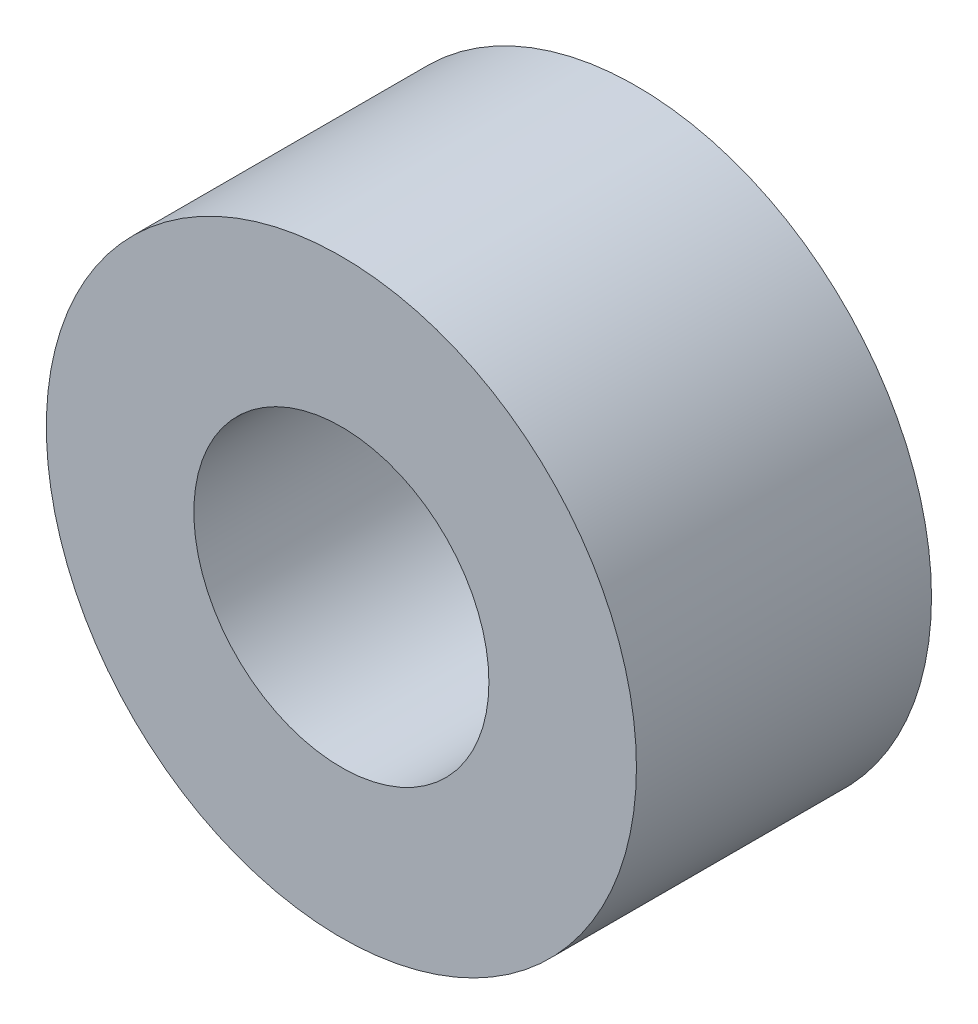
ISO-10303-21;
HEADER;
FILE_DESCRIPTION(('STEP AP214'),'2;1');
FILE_NAME('part.step','',(''),(''),'','','');
FILE_SCHEMA(('AUTOMOTIVE_DESIGN { 1 0 10303 214 1 1 1 1 }'));
ENDSEC;
DATA;
#1=APPLICATION_CONTEXT('core data for automotive mechanical design processes');
#2=APPLICATION_PROTOCOL_DEFINITION('international standard','automotive_design',2000,#1);
#3=PRODUCT_CONTEXT('',#1,'mechanical');
#4=PRODUCT('Part','Part','',(#3));
#5=PRODUCT_RELATED_PRODUCT_CATEGORY('part','',(#4));
#6=PRODUCT_DEFINITION_FORMATION('','',#4);
#7=PRODUCT_DEFINITION_CONTEXT('part definition',#1,'design');
#8=PRODUCT_DEFINITION('design','',#6,#7);
#9=PRODUCT_DEFINITION_SHAPE('','',#8);
#10=(LENGTH_UNIT() NAMED_UNIT(*) SI_UNIT(.MILLI.,.METRE.));
#11=(NAMED_UNIT(*) PLANE_ANGLE_UNIT() SI_UNIT($,.RADIAN.));
#12=(NAMED_UNIT(*) SI_UNIT($,.STERADIAN.) SOLID_ANGLE_UNIT());
#13=UNCERTAINTY_MEASURE_WITH_UNIT(LENGTH_MEASURE(1.E-05),#10,'distance_accuracy_value','');
#14=(GEOMETRIC_REPRESENTATION_CONTEXT(3) GLOBAL_UNCERTAINTY_ASSIGNED_CONTEXT((#13)) GLOBAL_UNIT_ASSIGNED_CONTEXT((#10,
#11,#12)) REPRESENTATION_CONTEXT('',''));
#15=CARTESIAN_POINT('',(0.,0.,0.));
#16=DIRECTION('',(0.,0.,1.));
#17=DIRECTION('',(1.,0.,0.));
#18=AXIS2_PLACEMENT_3D('',#15,#16,#17);
#19=CARTESIAN_POINT('',(0.,0.,1.58750000000001));
#20=DIRECTION('',(0.,0.,1.));
#21=DIRECTION('',(1.,0.,0.));
#22=AXIS2_PLACEMENT_3D('',#19,#20,#21);
#23=PLANE('',#22);
#24=CARTESIAN_POINT('',(0.,0.,1.58750000000001));
#25=DIRECTION('',(0.,0.,1.));
#26=DIRECTION('',(1.,0.,0.));
#27=AXIS2_PLACEMENT_3D('',#24,#25,#26);
#28=CIRCLE('',#27,3.175);
#29=CARTESIAN_POINT('',(3.175,0.,1.58750000000001));
#30=VERTEX_POINT('',#29);
#31=EDGE_CURVE('E10',#30,#30,#28,.T.);
#32=ORIENTED_EDGE('',*,*,#31,.T.);
#33=EDGE_LOOP('',(#32));
#34=FACE_BOUND('',#33,.T.);
#35=CARTESIAN_POINT('',(0.,0.,1.58750000000001));
#36=DIRECTION('',(0.,0.,1.));
#37=DIRECTION('',(1.,0.,0.));
#38=AXIS2_PLACEMENT_3D('',#35,#36,#37);
#39=CIRCLE('',#38,1.5875);
#40=CARTESIAN_POINT('',(1.5875,0.,1.58750000000001));
#41=VERTEX_POINT('',#40);
#42=EDGE_CURVE('E41',#41,#41,#39,.T.);
#43=ORIENTED_EDGE('',*,*,#42,.F.);
#44=EDGE_LOOP('',(#43));
#45=FACE_BOUND('',#44,.T.);
#46=ADVANCED_FACE('F30',(#34,#45),#23,.T.);
#47=CARTESIAN_POINT('',(0.,0.,-1.58749999999996));
#48=DIRECTION('',(0.,0.,1.));
#49=DIRECTION('',(1.,0.,0.));
#50=AXIS2_PLACEMENT_3D('',#47,#48,#49);
#51=PLANE('',#50);
#52=CARTESIAN_POINT('',(0.,0.,-1.58749999999996));
#53=DIRECTION('',(0.,0.,1.));
#54=DIRECTION('',(1.,0.,0.));
#55=AXIS2_PLACEMENT_3D('',#52,#53,#54);
#56=CIRCLE('',#55,3.175);
#57=CARTESIAN_POINT('',(3.17500000000001,0.,-1.58749999999996));
#58=VERTEX_POINT('',#57);
#59=EDGE_CURVE('E34',#58,#58,#56,.T.);
#60=ORIENTED_EDGE('',*,*,#59,.F.);
#61=EDGE_LOOP('',(#60));
#62=FACE_BOUND('',#61,.T.);
#63=CARTESIAN_POINT('',(0.,0.,-1.58749999999996));
#64=DIRECTION('',(0.,0.,1.));
#65=DIRECTION('',(1.,0.,0.));
#66=AXIS2_PLACEMENT_3D('',#63,#64,#65);
#67=CIRCLE('',#66,1.5875);
#68=CARTESIAN_POINT('',(1.58750000000001,0.,-1.58749999999996));
#69=VERTEX_POINT('',#68);
#70=EDGE_CURVE('E43',#69,#69,#67,.T.);
#71=ORIENTED_EDGE('',*,*,#70,.T.);
#72=EDGE_LOOP('',(#71));
#73=FACE_BOUND('',#72,.T.);
#74=ADVANCED_FACE('F53',(#62,#73),#51,.F.);
#75=CARTESIAN_POINT('',(0.,0.,1.58750000000001));
#76=DIRECTION('',(0.,0.,-1.));
#77=DIRECTION('',(-1.,0.,0.));
#78=AXIS2_PLACEMENT_3D('',#75,#76,#77);
#79=CYLINDRICAL_SURFACE('',#78,3.175);
#80=ORIENTED_EDGE('',*,*,#31,.F.);
#81=EDGE_LOOP('',(#80));
#82=FACE_BOUND('',#81,.T.);
#83=ORIENTED_EDGE('',*,*,#59,.T.);
#84=EDGE_LOOP('',(#83));
#85=FACE_BOUND('',#84,.T.);
#86=ADVANCED_FACE('F32',(#82,#85),#79,.T.);
#87=CARTESIAN_POINT('',(0.,0.,1.58750000000001));
#88=DIRECTION('',(0.,0.,-1.));
#89=DIRECTION('',(-1.,0.,0.));
#90=AXIS2_PLACEMENT_3D('',#87,#88,#89);
#91=CYLINDRICAL_SURFACE('',#90,1.5875);
#92=ORIENTED_EDGE('',*,*,#42,.T.);
#93=EDGE_LOOP('',(#92));
#94=FACE_BOUND('',#93,.T.);
#95=ORIENTED_EDGE('',*,*,#70,.F.);
#96=EDGE_LOOP('',(#95));
#97=FACE_BOUND('',#96,.T.);
#98=ADVANCED_FACE('F49',(#94,#97),#91,.F.);
#99=CLOSED_SHELL('',(#46,#74,#86,#98));
#100=MANIFOLD_SOLID_BREP('B2',#99);
#101=ADVANCED_BREP_SHAPE_REPRESENTATION('',(#18,#100),#14);
#102=SHAPE_DEFINITION_REPRESENTATION(#9,#101);
ENDSEC;
END-ISO-10303-21;
